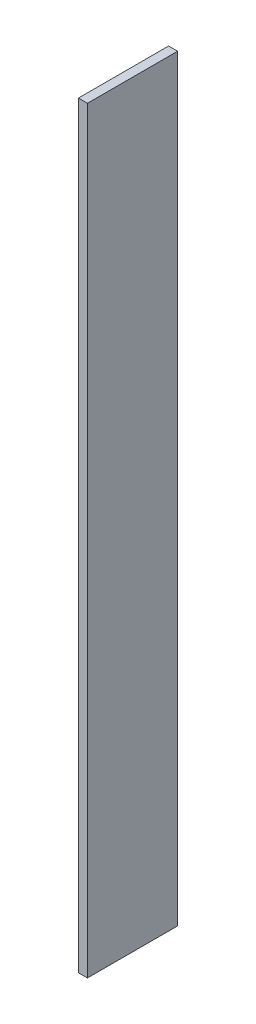
ISO-10303-21;
HEADER;
FILE_DESCRIPTION(('STEP AP214'),'2;1');
FILE_NAME('part.step','',(''),(''),'','','');
FILE_SCHEMA(('AUTOMOTIVE_DESIGN { 1 0 10303 214 1 1 1 1 }'));
ENDSEC;
DATA;
#1=APPLICATION_CONTEXT('core data for automotive mechanical design processes');
#2=APPLICATION_PROTOCOL_DEFINITION('international standard','automotive_design',2000,#1);
#3=PRODUCT_CONTEXT('',#1,'mechanical');
#4=PRODUCT('Part','Part','',(#3));
#5=PRODUCT_RELATED_PRODUCT_CATEGORY('part','',(#4));
#6=PRODUCT_DEFINITION_FORMATION('','',#4);
#7=PRODUCT_DEFINITION_CONTEXT('part definition',#1,'design');
#8=PRODUCT_DEFINITION('design','',#6,#7);
#9=PRODUCT_DEFINITION_SHAPE('','',#8);
#10=(LENGTH_UNIT() NAMED_UNIT(*) SI_UNIT(.MILLI.,.METRE.));
#11=(NAMED_UNIT(*) PLANE_ANGLE_UNIT() SI_UNIT($,.RADIAN.));
#12=(NAMED_UNIT(*) SI_UNIT($,.STERADIAN.) SOLID_ANGLE_UNIT());
#13=UNCERTAINTY_MEASURE_WITH_UNIT(LENGTH_MEASURE(1.E-05),#10,'distance_accuracy_value','');
#14=(GEOMETRIC_REPRESENTATION_CONTEXT(3) GLOBAL_UNCERTAINTY_ASSIGNED_CONTEXT((#13)) GLOBAL_UNIT_ASSIGNED_CONTEXT((#10,
#11,#12)) REPRESENTATION_CONTEXT('',''));
#15=CARTESIAN_POINT('',(0.,0.,0.));
#16=DIRECTION('',(0.,0.,1.));
#17=DIRECTION('',(1.,0.,0.));
#18=AXIS2_PLACEMENT_3D('',#15,#16,#17);
#19=CARTESIAN_POINT('',(2.5,25.,85.));
#20=DIRECTION('',(-1.,0.,0.));
#21=DIRECTION('',(0.,-1.,0.));
#22=AXIS2_PLACEMENT_3D('',#19,#20,#21);
#23=PLANE('',#22);
#24=DIRECTION('',(0.,0.,-1.));
#25=VECTOR('',#24,1.);
#26=CARTESIAN_POINT('',(2.5,25.,85.));
#27=LINE('',#26,#25);
#28=CARTESIAN_POINT('',(2.5,25.,85.));
#29=VERTEX_POINT('',#28);
#30=CARTESIAN_POINT('',(2.5,25.,35.));
#31=VERTEX_POINT('',#30);
#32=EDGE_CURVE('E57',#29,#31,#27,.T.);
#33=ORIENTED_EDGE('',*,*,#32,.T.);
#34=DIRECTION('',(0.,1.,0.));
#35=VECTOR('',#34,1.);
#36=CARTESIAN_POINT('',(2.5,25.,35.));
#37=LINE('',#36,#35);
#38=CARTESIAN_POINT('',(2.49999999999994,445.,35.));
#39=VERTEX_POINT('',#38);
#40=EDGE_CURVE('E97',#31,#39,#37,.T.);
#41=ORIENTED_EDGE('',*,*,#40,.T.);
#42=DIRECTION('',(0.,0.,-1.));
#43=VECTOR('',#42,1.);
#44=CARTESIAN_POINT('',(2.49999999999994,445.,85.));
#45=LINE('',#44,#43);
#46=CARTESIAN_POINT('',(2.49999999999994,445.,85.));
#47=VERTEX_POINT('',#46);
#48=EDGE_CURVE('E11',#47,#39,#45,.T.);
#49=ORIENTED_EDGE('',*,*,#48,.F.);
#50=DIRECTION('',(0.,1.,0.));
#51=VECTOR('',#50,1.);
#52=CARTESIAN_POINT('',(2.5,25.,85.));
#53=LINE('',#52,#51);
#54=EDGE_CURVE('E111',#29,#47,#53,.T.);
#55=ORIENTED_EDGE('',*,*,#54,.F.);
#56=EDGE_LOOP('',(#33,#41,#49,#55));
#57=FACE_BOUND('',#56,.T.);
#58=ADVANCED_FACE('F42',(#57),#23,.F.);
#59=CARTESIAN_POINT('',(-2.50000000000006,445.,85.));
#60=DIRECTION('',(0.,1.,0.));
#61=DIRECTION('',(0.,0.,1.));
#62=AXIS2_PLACEMENT_3D('',#59,#60,#61);
#63=PLANE('',#62);
#64=ORIENTED_EDGE('',*,*,#48,.T.);
#65=DIRECTION('',(1.,0.,0.));
#66=VECTOR('',#65,1.);
#67=CARTESIAN_POINT('',(-2.50000000000006,445.,35.));
#68=LINE('',#67,#66);
#69=CARTESIAN_POINT('',(-2.50000000000006,445.,35.));
#70=VERTEX_POINT('',#69);
#71=EDGE_CURVE('E87',#70,#39,#68,.T.);
#72=ORIENTED_EDGE('',*,*,#71,.F.);
#73=DIRECTION('',(0.,0.,-1.));
#74=VECTOR('',#73,1.);
#75=CARTESIAN_POINT('',(-2.50000000000006,445.,85.));
#76=LINE('',#75,#74);
#77=CARTESIAN_POINT('',(-2.50000000000006,445.,85.));
#78=VERTEX_POINT('',#77);
#79=EDGE_CURVE('E50',#78,#70,#76,.T.);
#80=ORIENTED_EDGE('',*,*,#79,.F.);
#81=DIRECTION('',(1.,0.,0.));
#82=VECTOR('',#81,1.);
#83=CARTESIAN_POINT('',(-2.50000000000006,445.,85.));
#84=LINE('',#83,#82);
#85=EDGE_CURVE('E89',#78,#47,#84,.T.);
#86=ORIENTED_EDGE('',*,*,#85,.T.);
#87=EDGE_LOOP('',(#64,#72,#80,#86));
#88=FACE_BOUND('',#87,.T.);
#89=ADVANCED_FACE('F86',(#88),#63,.T.);
#90=CARTESIAN_POINT('',(-2.5,25.,85.));
#91=DIRECTION('',(-1.,0.,0.));
#92=DIRECTION('',(0.,-1.,0.));
#93=AXIS2_PLACEMENT_3D('',#90,#91,#92);
#94=PLANE('',#93);
#95=ORIENTED_EDGE('',*,*,#79,.T.);
#96=DIRECTION('',(0.,1.,0.));
#97=VECTOR('',#96,1.);
#98=CARTESIAN_POINT('',(-2.5,25.,35.));
#99=LINE('',#98,#97);
#100=CARTESIAN_POINT('',(-2.5,25.,35.));
#101=VERTEX_POINT('',#100);
#102=EDGE_CURVE('E98',#101,#70,#99,.T.);
#103=ORIENTED_EDGE('',*,*,#102,.F.);
#104=DIRECTION('',(0.,0.,-1.));
#105=VECTOR('',#104,1.);
#106=CARTESIAN_POINT('',(-2.5,25.,85.));
#107=LINE('',#106,#105);
#108=CARTESIAN_POINT('',(-2.5,25.,85.));
#109=VERTEX_POINT('',#108);
#110=EDGE_CURVE('E65',#109,#101,#107,.T.);
#111=ORIENTED_EDGE('',*,*,#110,.F.);
#112=DIRECTION('',(0.,1.,0.));
#113=VECTOR('',#112,1.);
#114=CARTESIAN_POINT('',(-2.5,25.,85.));
#115=LINE('',#114,#113);
#116=EDGE_CURVE('E116',#109,#78,#115,.T.);
#117=ORIENTED_EDGE('',*,*,#116,.T.);
#118=EDGE_LOOP('',(#95,#103,#111,#117));
#119=FACE_BOUND('',#118,.T.);
#120=ADVANCED_FACE('F126',(#119),#94,.T.);
#121=CARTESIAN_POINT('',(2.5,25.,85.));
#122=DIRECTION('',(0.,-1.,0.));
#123=DIRECTION('',(0.,0.,-1.));
#124=AXIS2_PLACEMENT_3D('',#121,#122,#123);
#125=PLANE('',#124);
#126=ORIENTED_EDGE('',*,*,#110,.T.);
#127=DIRECTION('',(-1.,0.,0.));
#128=VECTOR('',#127,1.);
#129=CARTESIAN_POINT('',(2.5,25.,35.));
#130=LINE('',#129,#128);
#131=EDGE_CURVE('E108',#31,#101,#130,.T.);
#132=ORIENTED_EDGE('',*,*,#131,.F.);
#133=ORIENTED_EDGE('',*,*,#32,.F.);
#134=DIRECTION('',(-1.,0.,0.));
#135=VECTOR('',#134,1.);
#136=CARTESIAN_POINT('',(2.5,25.,85.));
#137=LINE('',#136,#135);
#138=EDGE_CURVE('E119',#29,#109,#137,.T.);
#139=ORIENTED_EDGE('',*,*,#138,.T.);
#140=EDGE_LOOP('',(#126,#132,#133,#139));
#141=FACE_BOUND('',#140,.T.);
#142=ADVANCED_FACE('F130',(#141),#125,.T.);
#143=CARTESIAN_POINT('',(0.,0.,85.));
#144=DIRECTION('',(0.,0.,-1.));
#145=DIRECTION('',(-1.,0.,0.));
#146=AXIS2_PLACEMENT_3D('',#143,#144,#145);
#147=PLANE('',#146);
#148=ORIENTED_EDGE('',*,*,#54,.T.);
#149=ORIENTED_EDGE('',*,*,#85,.F.);
#150=ORIENTED_EDGE('',*,*,#116,.F.);
#151=ORIENTED_EDGE('',*,*,#138,.F.);
#152=EDGE_LOOP('',(#148,#149,#150,#151));
#153=FACE_BOUND('',#152,.T.);
#154=ADVANCED_FACE('F128',(#153),#147,.F.);
#155=CARTESIAN_POINT('',(0.,0.,35.));
#156=DIRECTION('',(0.,0.,-1.));
#157=DIRECTION('',(-1.,0.,0.));
#158=AXIS2_PLACEMENT_3D('',#155,#156,#157);
#159=PLANE('',#158);
#160=ORIENTED_EDGE('',*,*,#40,.F.);
#161=ORIENTED_EDGE('',*,*,#131,.T.);
#162=ORIENTED_EDGE('',*,*,#102,.T.);
#163=ORIENTED_EDGE('',*,*,#71,.T.);
#164=EDGE_LOOP('',(#160,#161,#162,#163));
#165=FACE_BOUND('',#164,.T.);
#166=ADVANCED_FACE('F95',(#165),#159,.T.);
#167=CLOSED_SHELL('',(#58,#89,#120,#142,#154,#166));
#168=MANIFOLD_SOLID_BREP('B2',#167);
#169=ADVANCED_BREP_SHAPE_REPRESENTATION('',(#18,#168),#14);
#170=SHAPE_DEFINITION_REPRESENTATION(#9,#169);
ENDSEC;
END-ISO-10303-21;
